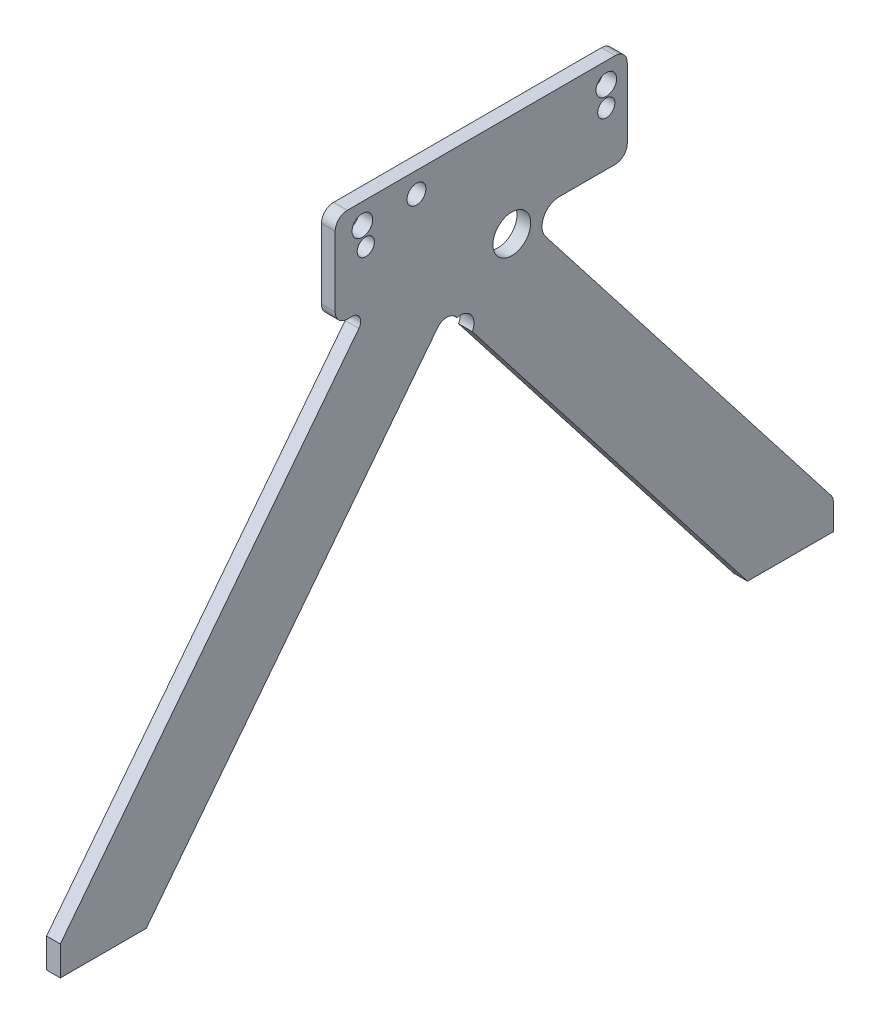
ISO-10303-21;
HEADER;
FILE_DESCRIPTION(('STEP AP214'),'2;1');
FILE_NAME('part.step','',(''),(''),'','','');
FILE_SCHEMA(('AUTOMOTIVE_DESIGN { 1 0 10303 214 1 1 1 1 }'));
ENDSEC;
DATA;
#1=APPLICATION_CONTEXT('core data for automotive mechanical design processes');
#2=APPLICATION_PROTOCOL_DEFINITION('international standard','automotive_design',2000,#1);
#3=PRODUCT_CONTEXT('',#1,'mechanical');
#4=PRODUCT('Part','Part','',(#3));
#5=PRODUCT_RELATED_PRODUCT_CATEGORY('part','',(#4));
#6=PRODUCT_DEFINITION_FORMATION('','',#4);
#7=PRODUCT_DEFINITION_CONTEXT('part definition',#1,'design');
#8=PRODUCT_DEFINITION('design','',#6,#7);
#9=PRODUCT_DEFINITION_SHAPE('','',#8);
#10=(LENGTH_UNIT() NAMED_UNIT(*) SI_UNIT(.MILLI.,.METRE.));
#11=(NAMED_UNIT(*) PLANE_ANGLE_UNIT() SI_UNIT($,.RADIAN.));
#12=(NAMED_UNIT(*) SI_UNIT($,.STERADIAN.) SOLID_ANGLE_UNIT());
#13=UNCERTAINTY_MEASURE_WITH_UNIT(LENGTH_MEASURE(1.E-05),#10,'distance_accuracy_value','');
#14=(GEOMETRIC_REPRESENTATION_CONTEXT(3) GLOBAL_UNCERTAINTY_ASSIGNED_CONTEXT((#13)) GLOBAL_UNIT_ASSIGNED_CONTEXT((#10,
#11,#12)) REPRESENTATION_CONTEXT('',''));
#15=CARTESIAN_POINT('',(0.,0.,0.));
#16=DIRECTION('',(0.,0.,1.));
#17=DIRECTION('',(1.,0.,0.));
#18=AXIS2_PLACEMENT_3D('',#15,#16,#17);
#19=CARTESIAN_POINT('',(1218.5,-25.,140.));
#20=DIRECTION('',(0.,0.,1.));
#21=DIRECTION('',(-1.,0.,0.));
#22=AXIS2_PLACEMENT_3D('',#19,#20,#21);
#23=PLANE('',#22);
#24=DIRECTION('',(1.,0.,0.));
#25=VECTOR('',#24,1.);
#26=CARTESIAN_POINT('',(678.5,17.1587321188457,140.));
#27=LINE('',#26,#25);
#28=CARTESIAN_POINT('',(670.5,17.1587321188458,140.));
#29=VERTEX_POINT('',#28);
#30=CARTESIAN_POINT('',(678.5,17.1587321188457,140.));
#31=VERTEX_POINT('',#30);
#32=EDGE_CURVE('E321',#29,#31,#27,.T.);
#33=ORIENTED_EDGE('',*,*,#32,.F.);
#34=DIRECTION('',(0.,1.,0.));
#35=VECTOR('',#34,1.);
#36=CARTESIAN_POINT('',(670.5,0.,140.));
#37=LINE('',#36,#35);
#38=CARTESIAN_POINT('',(670.5,0.,140.));
#39=VERTEX_POINT('',#38);
#40=EDGE_CURVE('E326',#39,#29,#37,.T.);
#41=ORIENTED_EDGE('',*,*,#40,.F.);
#42=DIRECTION('',(-1.,0.,0.));
#43=VECTOR('',#42,1.);
#44=CARTESIAN_POINT('',(1218.5,0.,140.));
#45=LINE('',#44,#43);
#46=CARTESIAN_POINT('',(678.500000000002,0.,140.));
#47=VERTEX_POINT('',#46);
#48=EDGE_CURVE('E322',#47,#39,#45,.T.);
#49=ORIENTED_EDGE('',*,*,#48,.F.);
#50=DIRECTION('',(0.,-1.,0.));
#51=VECTOR('',#50,1.);
#52=CARTESIAN_POINT('',(678.5,0.,140.));
#53=LINE('',#52,#51);
#54=EDGE_CURVE('E327',#31,#47,#53,.T.);
#55=ORIENTED_EDGE('',*,*,#54,.F.);
#56=EDGE_LOOP('',(#33,#41,#49,#55));
#57=FACE_BOUND('',#56,.T.);
#58=ADVANCED_FACE('F40',(#57),#23,.T.);
#59=CARTESIAN_POINT('',(1218.5,0.,115.));
#60=DIRECTION('',(0.,1.,0.));
#61=DIRECTION('',(0.,0.,1.));
#62=AXIS2_PLACEMENT_3D('',#59,#60,#61);
#63=PLANE('',#62);
#64=ORIENTED_EDGE('',*,*,#48,.T.);
#65=DIRECTION('',(0.,0.,-1.));
#66=VECTOR('',#65,1.);
#67=CARTESIAN_POINT('',(670.5,0.,89.9999999999999));
#68=LINE('',#67,#66);
#69=CARTESIAN_POINT('',(670.5,0.,89.9999999999999));
#70=VERTEX_POINT('',#69);
#71=EDGE_CURVE('E315',#39,#70,#68,.T.);
#72=ORIENTED_EDGE('',*,*,#71,.T.);
#73=DIRECTION('',(1.,0.,0.));
#74=VECTOR('',#73,1.);
#75=CARTESIAN_POINT('',(670.5,0.,89.9999999999999));
#76=LINE('',#75,#74);
#77=CARTESIAN_POINT('',(678.5,0.,89.9999999999999));
#78=VERTEX_POINT('',#77);
#79=EDGE_CURVE('E302',#70,#78,#76,.T.);
#80=ORIENTED_EDGE('',*,*,#79,.T.);
#81=DIRECTION('',(0.,0.,1.));
#82=VECTOR('',#81,1.);
#83=CARTESIAN_POINT('',(678.5,0.,89.9999999999999));
#84=LINE('',#83,#82);
#85=EDGE_CURVE('E306',#78,#47,#84,.T.);
#86=ORIENTED_EDGE('',*,*,#85,.T.);
#87=EDGE_LOOP('',(#64,#72,#80,#86));
#88=FACE_BOUND('',#87,.T.);
#89=ADVANCED_FACE('F530',(#88),#63,.F.);
#90=CARTESIAN_POINT('',(670.5,0.,89.9999999999999));
#91=DIRECTION('',(1.,0.,0.));
#92=DIRECTION('',(0.,0.,1.));
#93=AXIS2_PLACEMENT_3D('',#90,#91,#92);
#94=PLANE('',#93);
#95=DIRECTION('',(0.,0.,-1.));
#96=VECTOR('',#95,1.);
#97=CARTESIAN_POINT('',(670.5,303.487439771462,-190.));
#98=LINE('',#97,#96);
#99=CARTESIAN_POINT('',(670.5,303.487439771462,-27.0000000000004));
#100=VERTEX_POINT('',#99);
#101=CARTESIAN_POINT('',(670.5,303.487439771462,-183.));
#102=VERTEX_POINT('',#101);
#103=EDGE_CURVE('E430',#100,#102,#98,.T.);
#104=ORIENTED_EDGE('',*,*,#103,.T.);
#105=CARTESIAN_POINT('',(670.5,296.487439771462,-183.));
#106=DIRECTION('',(1.,0.,0.));
#107=DIRECTION('',(0.,0.,-1.));
#108=AXIS2_PLACEMENT_3D('',#105,#106,#107);
#109=CIRCLE('',#108,7.);
#110=CARTESIAN_POINT('',(670.5,296.487439771462,-190.));
#111=VERTEX_POINT('',#110);
#112=EDGE_CURVE('E389',#102,#111,#109,.F.);
#113=ORIENTED_EDGE('',*,*,#112,.T.);
#114=DIRECTION('',(0.,1.,0.));
#115=VECTOR('',#114,1.);
#116=CARTESIAN_POINT('',(670.5,348.622799434992,-190.));
#117=LINE('',#116,#115);
#118=CARTESIAN_POINT('',(670.5,255.622799434992,-190.));
#119=VERTEX_POINT('',#118);
#120=EDGE_CURVE('E451',#119,#111,#117,.T.);
#121=ORIENTED_EDGE('',*,*,#120,.F.);
#122=CARTESIAN_POINT('',(670.5,255.622799434992,-183.));
#123=DIRECTION('',(1.,0.,0.));
#124=DIRECTION('',(0.,0.,-1.));
#125=AXIS2_PLACEMENT_3D('',#122,#123,#124);
#126=CIRCLE('',#125,7.);
#127=CARTESIAN_POINT('',(670.5,248.622799434992,-183.));
#128=VERTEX_POINT('',#127);
#129=EDGE_CURVE('E203',#119,#128,#126,.F.);
#130=ORIENTED_EDGE('',*,*,#129,.T.);
#131=DIRECTION('',(0.,0.,1.));
#132=VECTOR('',#131,1.);
#133=CARTESIAN_POINT('',(670.5,248.622799434992,-190.));
#134=LINE('',#133,#132);
#135=CARTESIAN_POINT('',(670.5,248.622799434992,-150.377418681843));
#136=VERTEX_POINT('',#135);
#137=EDGE_CURVE('E193',#128,#136,#134,.T.);
#138=ORIENTED_EDGE('',*,*,#137,.T.);
#139=CARTESIAN_POINT('',(670.5,238.622799434992,-150.377418681843));
#140=DIRECTION('',(1.,0.,0.));
#141=DIRECTION('',(0.,0.,-1.));
#142=AXIS2_PLACEMENT_3D('',#139,#140,#141);
#143=CIRCLE('',#142,9.99999999999999);
#144=CARTESIAN_POINT('',(670.5,232.482448557799,-142.484631398192));
#145=VERTEX_POINT('',#144);
#146=EDGE_CURVE('E200',#136,#145,#143,.T.);
#147=ORIENTED_EDGE('',*,*,#146,.T.);
#148=DIRECTION('',(0.,0.789278728365052,0.614035087719298));
#149=VECTOR('',#148,1.);
#150=CARTESIAN_POINT('',(670.5,30.701754385965,-299.463936418253));
#151=LINE('',#150,#149);
#152=CARTESIAN_POINT('',(670.5,19.0547552362425,-308.524951098556));
#153=VERTEX_POINT('',#152);
#154=EDGE_CURVE('E267',#153,#145,#151,.T.);
#155=ORIENTED_EDGE('',*,*,#154,.F.);
#156=CARTESIAN_POINT('',(670.499999999999,14.7565096222074,-303.));
#157=DIRECTION('',(1.,0.,0.));
#158=DIRECTION('',(0.,0.,-1.));
#159=AXIS2_PLACEMENT_3D('',#156,#157,#158);
#160=CIRCLE('',#159,7.);
#161=CARTESIAN_POINT('',(670.5,14.7565096222074,-310.));
#162=VERTEX_POINT('',#161);
#163=EDGE_CURVE('E378',#153,#162,#160,.F.);
#164=ORIENTED_EDGE('',*,*,#163,.T.);
#165=DIRECTION('',(0.,-1.,0.));
#166=VECTOR('',#165,1.);
#167=CARTESIAN_POINT('',(670.5,30.701754385965,-310.));
#168=LINE('',#167,#166);
#169=CARTESIAN_POINT('',(670.499999999998,0.,-310.));
#170=VERTEX_POINT('',#169);
#171=EDGE_CURVE('E277',#162,#170,#168,.T.);
#172=ORIENTED_EDGE('',*,*,#171,.T.);
#173=DIRECTION('',(0.,0.,-1.));
#174=VECTOR('',#173,1.);
#175=CARTESIAN_POINT('',(670.5,0.,-299.463936418253));
#176=LINE('',#175,#174);
#177=CARTESIAN_POINT('',(670.5,0.,-260.));
#178=VERTEX_POINT('',#177);
#179=EDGE_CURVE('E268',#178,#170,#176,.T.);
#180=ORIENTED_EDGE('',*,*,#179,.F.);
#181=DIRECTION('',(0.,0.789278728365052,0.614035087719298));
#182=VECTOR('',#181,1.);
#183=CARTESIAN_POINT('',(670.5,0.,-260.));
#184=LINE('',#183,#182);
#185=CARTESIAN_POINT('',(670.5,205.90096578664,-99.8152477133378));
#186=VERTEX_POINT('',#185);
#187=EDGE_CURVE('E251',#178,#186,#184,.T.);
#188=ORIENTED_EDGE('',*,*,#187,.T.);
#189=CARTESIAN_POINT('',(670.5,209.737439771461,-92.7951716907497));
#190=DIRECTION('',(1.,0.,0.));
#191=DIRECTION('',(0.,0.,-1.));
#192=AXIS2_PLACEMENT_3D('',#189,#190,#191);
#193=CIRCLE('',#192,7.9999999999453);
#194=CARTESIAN_POINT('',(670.5,217.485399590374,-90.8029069885487));
#195=VERTEX_POINT('',#194);
#196=EDGE_CURVE('E241',#186,#195,#193,.T.);
#197=ORIENTED_EDGE('',*,*,#196,.T.);
#198=CARTESIAN_POINT('',(670.5,217.842683198075,-90.5249510985555));
#199=VERTEX_POINT('',#198);
#200=EDGE_CURVE('E256',#195,#199,#184,.T.);
#201=ORIENTED_EDGE('',*,*,#200,.T.);
#202=CARTESIAN_POINT('',(670.5,213.54443758404,-85.0000000000001));
#203=DIRECTION('',(1.,0.,0.));
#204=DIRECTION('',(0.,0.,-1.));
#205=AXIS2_PLACEMENT_3D('',#202,#203,#204);
#206=CIRCLE('',#205,7.);
#207=CARTESIAN_POINT('',(670.5,217.842683198075,-79.4750489014448));
#208=VERTEX_POINT('',#207);
#209=EDGE_CURVE('E49',#199,#208,#206,.T.);
#210=ORIENTED_EDGE('',*,*,#209,.T.);
#211=DIRECTION('',(0.,0.789278728365052,-0.614035087719298));
#212=VECTOR('',#211,1.);
#213=CARTESIAN_POINT('',(670.5,0.,89.9999999999999));
#214=LINE('',#213,#212);
#215=EDGE_CURVE('E295',#70,#208,#214,.T.);
#216=ORIENTED_EDGE('',*,*,#215,.F.);
#217=ORIENTED_EDGE('',*,*,#71,.F.);
#218=ORIENTED_EDGE('',*,*,#40,.T.);
#219=DIRECTION('',(0.,0.789278728365052,-0.614035087719298));
#220=VECTOR('',#219,1.);
#221=CARTESIAN_POINT('',(670.5,30.701754385965,129.463936418253));
#222=LINE('',#221,#220);
#223=CARTESIAN_POINT('',(670.5,240.552623996395,-33.7937221228935));
#224=VERTEX_POINT('',#223);
#225=EDGE_CURVE('E311',#29,#224,#222,.T.);
#226=ORIENTED_EDGE('',*,*,#225,.T.);
#227=CARTESIAN_POINT('',(670.5,243.622799434992,-29.8473284810682));
#228=DIRECTION('',(1.,0.,0.));
#229=DIRECTION('',(0.,0.,-1.));
#230=AXIS2_PLACEMENT_3D('',#227,#228,#229);
#231=CIRCLE('',#230,5.);
#232=CARTESIAN_POINT('',(670.5,248.622799434992,-29.8473284810682));
#233=VERTEX_POINT('',#232);
#234=EDGE_CURVE('E414',#224,#233,#231,.T.);
#235=ORIENTED_EDGE('',*,*,#234,.T.);
#236=CARTESIAN_POINT('',(670.5,248.622799434992,-27.0000000000004));
#237=VERTEX_POINT('',#236);
#238=EDGE_CURVE('E208',#233,#237,#134,.T.);
#239=ORIENTED_EDGE('',*,*,#238,.T.);
#240=CARTESIAN_POINT('',(670.5,255.622799434992,-27.0000000000004));
#241=DIRECTION('',(1.,0.,0.));
#242=DIRECTION('',(0.,0.,-1.));
#243=AXIS2_PLACEMENT_3D('',#240,#241,#242);
#244=CIRCLE('',#243,7.);
#245=CARTESIAN_POINT('',(670.5,255.622799434992,-20.0000000000004));
#246=VERTEX_POINT('',#245);
#247=EDGE_CURVE('E381',#237,#246,#244,.F.);
#248=ORIENTED_EDGE('',*,*,#247,.T.);
#249=DIRECTION('',(0.,1.,0.));
#250=VECTOR('',#249,1.);
#251=CARTESIAN_POINT('',(670.5,348.622799434992,-20.0000000000004));
#252=LINE('',#251,#250);
#253=CARTESIAN_POINT('',(670.5,296.487439771462,-20.0000000000004));
#254=VERTEX_POINT('',#253);
#255=EDGE_CURVE('E423',#246,#254,#252,.T.);
#256=ORIENTED_EDGE('',*,*,#255,.T.);
#257=CARTESIAN_POINT('',(670.500000000001,296.487439771462,-27.0000000000004));
#258=DIRECTION('',(1.,0.,0.));
#259=DIRECTION('',(0.,0.,-1.));
#260=AXIS2_PLACEMENT_3D('',#257,#258,#259);
#261=CIRCLE('',#260,7.);
#262=EDGE_CURVE('E386',#254,#100,#261,.F.);
#263=ORIENTED_EDGE('',*,*,#262,.T.);
#264=EDGE_LOOP('',(#104,#113,#121,#130,#138,#147,#155,#164,#172,#180,#188,#197,#201,#210,#216,
#217,#218,#226,#235,#239,#248,#256,#263));
#265=FACE_BOUND('',#264,.T.);
#266=CARTESIAN_POINT('',(670.5,243.73743977146,-122.79517169075));
#267=DIRECTION('',(1.,0.,0.));
#268=DIRECTION('',(0.,0.,-1.));
#269=AXIS2_PLACEMENT_3D('',#266,#267,#268);
#270=CIRCLE('',#269,10.9999999999903);
#271=CARTESIAN_POINT('',(670.5,243.73743977146,-133.79517169074));
#272=VERTEX_POINT('',#271);
#273=EDGE_CURVE('E246',#272,#272,#270,.T.);
#274=ORIENTED_EDGE('',*,*,#273,.T.);
#275=EDGE_LOOP('',(#274));
#276=FACE_BOUND('',#275,.T.);
#277=CARTESIAN_POINT('',(670.5,279.737439771462,-37.795171690751));
#278=DIRECTION('',(1.,0.,0.));
#279=DIRECTION('',(0.,0.,-1.));
#280=AXIS2_PLACEMENT_3D('',#277,#278,#279);
#281=CIRCLE('',#280,4.99999999994735);
#282=CARTESIAN_POINT('',(670.5,279.737439771462,-42.7951716906983));
#283=VERTEX_POINT('',#282);
#284=EDGE_CURVE('E236',#283,#283,#281,.T.);
#285=ORIENTED_EDGE('',*,*,#284,.T.);
#286=EDGE_LOOP('',(#285));
#287=FACE_BOUND('',#286,.T.);
#288=CARTESIAN_POINT('',(670.5,291.487439771464,-177.795171690753));
#289=DIRECTION('',(1.,0.,0.));
#290=DIRECTION('',(0.,0.,-1.));
#291=AXIS2_PLACEMENT_3D('',#288,#289,#290);
#292=CIRCLE('',#291,5.99999999996128);
#293=CARTESIAN_POINT('',(670.5,291.487439771464,-183.795171690715));
#294=VERTEX_POINT('',#293);
#295=EDGE_CURVE('E500',#294,#294,#292,.T.);
#296=ORIENTED_EDGE('',*,*,#295,.T.);
#297=EDGE_LOOP('',(#296));
#298=FACE_BOUND('',#297,.T.);
#299=CARTESIAN_POINT('',(670.5,279.737439771459,-177.795171690751));
#300=DIRECTION('',(1.,0.,0.));
#301=DIRECTION('',(0.,0.,-1.));
#302=AXIS2_PLACEMENT_3D('',#299,#300,#301);
#303=CIRCLE('',#302,4.99999999994802);
#304=CARTESIAN_POINT('',(670.5,279.737439771459,-182.795171690699));
#305=VERTEX_POINT('',#304);
#306=EDGE_CURVE('E495',#305,#305,#303,.T.);
#307=ORIENTED_EDGE('',*,*,#306,.T.);
#308=EDGE_LOOP('',(#307));
#309=FACE_BOUND('',#308,.T.);
#310=CARTESIAN_POINT('',(670.5,291.487439771462,-35.7951716907509));
#311=DIRECTION('',(1.,0.,0.));
#312=DIRECTION('',(0.,0.,-1.));
#313=AXIS2_PLACEMENT_3D('',#310,#311,#312);
#314=CIRCLE('',#313,5.9999999999686);
#315=CARTESIAN_POINT('',(670.5,291.487439771462,-41.7951716907195));
#316=VERTEX_POINT('',#315);
#317=EDGE_CURVE('E490',#316,#316,#314,.T.);
#318=ORIENTED_EDGE('',*,*,#317,.T.);
#319=EDGE_LOOP('',(#318));
#320=FACE_BOUND('',#319,.T.);
#321=CARTESIAN_POINT('',(670.5,291.487439771461,-67.2951716907509));
#322=DIRECTION('',(1.,0.,0.));
#323=DIRECTION('',(0.,0.,-1.));
#324=AXIS2_PLACEMENT_3D('',#321,#322,#323);
#325=CIRCLE('',#324,5.49999999995604);
#326=CARTESIAN_POINT('',(670.5,291.487439771461,-72.795171690707));
#327=VERTEX_POINT('',#326);
#328=EDGE_CURVE('E433',#327,#327,#325,.T.);
#329=ORIENTED_EDGE('',*,*,#328,.T.);
#330=EDGE_LOOP('',(#329));
#331=FACE_BOUND('',#330,.T.);
#332=ADVANCED_FACE('F196',(#265,#276,#287,#298,#309,#320,#331),#94,.F.);
#333=CARTESIAN_POINT('',(678.5,30.701754385965,129.463936418252));
#334=DIRECTION('',(0.,-0.614035087719298,-0.789278728365052));
#335=DIRECTION('',(0.,0.789278728365052,-0.614035087719298));
#336=AXIS2_PLACEMENT_3D('',#333,#334,#335);
#337=PLANE('',#336);
#338=DIRECTION('',(0.,0.789278728365052,-0.614035087719298));
#339=VECTOR('',#338,1.);
#340=CARTESIAN_POINT('',(678.5,30.701754385965,129.463936418252));
#341=LINE('',#340,#339);
#342=CARTESIAN_POINT('',(678.5,240.552623996395,-33.7937221228936));
#343=VERTEX_POINT('',#342);
#344=EDGE_CURVE('E307',#31,#343,#341,.T.);
#345=ORIENTED_EDGE('',*,*,#344,.T.);
#346=DIRECTION('',(-1.,0.,0.));
#347=VECTOR('',#346,1.);
#348=CARTESIAN_POINT('',(670.5,240.552623996395,-33.7937221228935));
#349=LINE('',#348,#347);
#350=EDGE_CURVE('E337',#343,#224,#349,.T.);
#351=ORIENTED_EDGE('',*,*,#350,.T.);
#352=ORIENTED_EDGE('',*,*,#225,.F.);
#353=ORIENTED_EDGE('',*,*,#32,.T.);
#354=EDGE_LOOP('',(#345,#351,#352,#353));
#355=FACE_BOUND('',#354,.T.);
#356=ADVANCED_FACE('F534',(#355),#337,.F.);
#357=CARTESIAN_POINT('',(678.5,0.,89.9999999999999));
#358=DIRECTION('',(-1.,0.,0.));
#359=DIRECTION('',(0.,0.,-1.));
#360=AXIS2_PLACEMENT_3D('',#357,#358,#359);
#361=PLANE('',#360);
#362=DIRECTION('',(0.,-1.,0.));
#363=VECTOR('',#362,1.);
#364=CARTESIAN_POINT('',(678.5,348.622799434992,-190.));
#365=LINE('',#364,#363);
#366=CARTESIAN_POINT('',(678.5,296.487439771462,-190.));
#367=VERTEX_POINT('',#366);
#368=CARTESIAN_POINT('',(678.5,255.622799434992,-190.));
#369=VERTEX_POINT('',#368);
#370=EDGE_CURVE('E427',#367,#369,#365,.T.);
#371=ORIENTED_EDGE('',*,*,#370,.F.);
#372=CARTESIAN_POINT('',(678.5,296.487439771462,-183.));
#373=DIRECTION('',(-1.,0.,0.));
#374=DIRECTION('',(0.,0.,1.));
#375=AXIS2_PLACEMENT_3D('',#372,#373,#374);
#376=CIRCLE('',#375,7.);
#377=CARTESIAN_POINT('',(678.499999999998,303.487439771462,-183.));
#378=VERTEX_POINT('',#377);
#379=EDGE_CURVE('E368',#367,#378,#376,.F.);
#380=ORIENTED_EDGE('',*,*,#379,.T.);
#381=DIRECTION('',(0.,0.,-1.));
#382=VECTOR('',#381,1.);
#383=CARTESIAN_POINT('',(678.499999999998,303.487439771462,-1.93856793595813E-12));
#384=LINE('',#383,#382);
#385=CARTESIAN_POINT('',(678.499999999998,303.487439771462,-27.0000000000004));
#386=VERTEX_POINT('',#385);
#387=EDGE_CURVE('E434',#386,#378,#384,.T.);
#388=ORIENTED_EDGE('',*,*,#387,.F.);
#389=CARTESIAN_POINT('',(678.500000000001,296.487439771462,-27.0000000000004));
#390=DIRECTION('',(-1.,0.,0.));
#391=DIRECTION('',(0.,0.,1.));
#392=AXIS2_PLACEMENT_3D('',#389,#390,#391);
#393=CIRCLE('',#392,7.);
#394=CARTESIAN_POINT('',(678.5,296.487439771462,-20.0000000000004));
#395=VERTEX_POINT('',#394);
#396=EDGE_CURVE('E365',#386,#395,#393,.F.);
#397=ORIENTED_EDGE('',*,*,#396,.T.);
#398=DIRECTION('',(0.,-1.,0.));
#399=VECTOR('',#398,1.);
#400=CARTESIAN_POINT('',(678.5,348.622799434992,-20.0000000000004));
#401=LINE('',#400,#399);
#402=CARTESIAN_POINT('',(678.5,255.622799434992,-20.0000000000004));
#403=VERTEX_POINT('',#402);
#404=EDGE_CURVE('E428',#395,#403,#401,.T.);
#405=ORIENTED_EDGE('',*,*,#404,.T.);
#406=CARTESIAN_POINT('',(678.5,255.622799434992,-27.0000000000004));
#407=DIRECTION('',(-1.,0.,0.));
#408=DIRECTION('',(0.,0.,1.));
#409=AXIS2_PLACEMENT_3D('',#406,#407,#408);
#410=CIRCLE('',#409,7.);
#411=CARTESIAN_POINT('',(678.5,248.622799434992,-27.0000000000004));
#412=VERTEX_POINT('',#411);
#413=EDGE_CURVE('E359',#403,#412,#410,.F.);
#414=ORIENTED_EDGE('',*,*,#413,.T.);
#415=DIRECTION('',(0.,0.,1.));
#416=VECTOR('',#415,1.);
#417=CARTESIAN_POINT('',(678.5,248.622799434992,-190.));
#418=LINE('',#417,#416);
#419=CARTESIAN_POINT('',(678.5,248.622799434992,-29.8473284810682));
#420=VERTEX_POINT('',#419);
#421=EDGE_CURVE('E207',#420,#412,#418,.T.);
#422=ORIENTED_EDGE('',*,*,#421,.F.);
#423=CARTESIAN_POINT('',(678.5,243.622799434992,-29.8473284810682));
#424=DIRECTION('',(-1.,0.,0.));
#425=DIRECTION('',(0.,0.,1.));
#426=AXIS2_PLACEMENT_3D('',#423,#424,#425);
#427=CIRCLE('',#426,5.);
#428=EDGE_CURVE('E417',#420,#343,#427,.T.);
#429=ORIENTED_EDGE('',*,*,#428,.T.);
#430=ORIENTED_EDGE('',*,*,#344,.F.);
#431=ORIENTED_EDGE('',*,*,#54,.T.);
#432=ORIENTED_EDGE('',*,*,#85,.F.);
#433=DIRECTION('',(0.,0.789278728365052,-0.614035087719298));
#434=VECTOR('',#433,1.);
#435=CARTESIAN_POINT('',(678.5,0.,89.9999999999999));
#436=LINE('',#435,#434);
#437=CARTESIAN_POINT('',(678.5,217.842683198075,-79.4750489014448));
#438=VERTEX_POINT('',#437);
#439=EDGE_CURVE('E298',#78,#438,#436,.T.);
#440=ORIENTED_EDGE('',*,*,#439,.T.);
#441=CARTESIAN_POINT('',(678.5,213.54443758404,-85.0000000000002));
#442=DIRECTION('',(-1.,0.,0.));
#443=DIRECTION('',(0.,0.,1.));
#444=AXIS2_PLACEMENT_3D('',#441,#442,#443);
#445=CIRCLE('',#444,7.);
#446=CARTESIAN_POINT('',(678.5,217.842683198075,-90.5249510985556));
#447=VERTEX_POINT('',#446);
#448=EDGE_CURVE('E12',#438,#447,#445,.T.);
#449=ORIENTED_EDGE('',*,*,#448,.T.);
#450=DIRECTION('',(0.,0.789278728365052,0.614035087719298));
#451=VECTOR('',#450,1.);
#452=CARTESIAN_POINT('',(678.5,0.,-260.));
#453=LINE('',#452,#451);
#454=CARTESIAN_POINT('',(678.499999999999,217.485399590374,-90.8029069885487));
#455=VERTEX_POINT('',#454);
#456=EDGE_CURVE('E255',#455,#447,#453,.T.);
#457=ORIENTED_EDGE('',*,*,#456,.F.);
#458=CARTESIAN_POINT('',(678.499999999999,209.737439771461,-92.7951716907497));
#459=DIRECTION('',(1.,0.,0.));
#460=DIRECTION('',(0.,1.,0.));
#461=AXIS2_PLACEMENT_3D('',#458,#459,#460);
#462=CIRCLE('',#461,7.9999999999453);
#463=CARTESIAN_POINT('',(678.499999999999,205.90096578664,-99.8152477133378));
#464=VERTEX_POINT('',#463);
#465=EDGE_CURVE('E230',#464,#455,#462,.T.);
#466=ORIENTED_EDGE('',*,*,#465,.F.);
#467=CARTESIAN_POINT('',(678.5,0.,-260.));
#468=VERTEX_POINT('',#467);
#469=EDGE_CURVE('E257',#468,#464,#453,.T.);
#470=ORIENTED_EDGE('',*,*,#469,.F.);
#471=DIRECTION('',(0.,0.,1.));
#472=VECTOR('',#471,1.);
#473=CARTESIAN_POINT('',(678.5,0.,-299.463936418253));
#474=LINE('',#473,#472);
#475=CARTESIAN_POINT('',(678.5,0.,-310.));
#476=VERTEX_POINT('',#475);
#477=EDGE_CURVE('E261',#476,#468,#474,.T.);
#478=ORIENTED_EDGE('',*,*,#477,.F.);
#479=DIRECTION('',(0.,1.,0.));
#480=VECTOR('',#479,1.);
#481=CARTESIAN_POINT('',(678.5,30.701754385965,-310.));
#482=LINE('',#481,#480);
#483=CARTESIAN_POINT('',(678.5,14.7565096222074,-310.));
#484=VERTEX_POINT('',#483);
#485=EDGE_CURVE('E276',#476,#484,#482,.T.);
#486=ORIENTED_EDGE('',*,*,#485,.T.);
#487=CARTESIAN_POINT('',(678.499999999999,14.7565096222074,-303.));
#488=DIRECTION('',(-1.,0.,0.));
#489=DIRECTION('',(0.,0.,1.));
#490=AXIS2_PLACEMENT_3D('',#487,#488,#489);
#491=CIRCLE('',#490,7.);
#492=CARTESIAN_POINT('',(678.5,19.0547552362425,-308.524951098556));
#493=VERTEX_POINT('',#492);
#494=EDGE_CURVE('E356',#484,#493,#491,.F.);
#495=ORIENTED_EDGE('',*,*,#494,.T.);
#496=DIRECTION('',(0.,0.789278728365052,0.614035087719298));
#497=VECTOR('',#496,1.);
#498=CARTESIAN_POINT('',(678.5,30.701754385965,-299.463936418253));
#499=LINE('',#498,#497);
#500=CARTESIAN_POINT('',(678.5,232.482448557799,-142.484631398192));
#501=VERTEX_POINT('',#500);
#502=EDGE_CURVE('E272',#493,#501,#499,.T.);
#503=ORIENTED_EDGE('',*,*,#502,.T.);
#504=CARTESIAN_POINT('',(678.5,238.622799434992,-150.377418681843));
#505=DIRECTION('',(-1.,0.,0.));
#506=DIRECTION('',(0.,0.,1.));
#507=AXIS2_PLACEMENT_3D('',#504,#505,#506);
#508=CIRCLE('',#507,9.99999999999999);
#509=CARTESIAN_POINT('',(678.5,248.622799434992,-150.377418681843));
#510=VERTEX_POINT('',#509);
#511=EDGE_CURVE('E220',#501,#510,#508,.T.);
#512=ORIENTED_EDGE('',*,*,#511,.T.);
#513=CARTESIAN_POINT('',(678.5,248.622799434992,-183.));
#514=VERTEX_POINT('',#513);
#515=EDGE_CURVE('E214',#514,#510,#418,.T.);
#516=ORIENTED_EDGE('',*,*,#515,.F.);
#517=CARTESIAN_POINT('',(678.5,255.622799434992,-183.));
#518=DIRECTION('',(-1.,0.,0.));
#519=DIRECTION('',(0.,0.,1.));
#520=AXIS2_PLACEMENT_3D('',#517,#518,#519);
#521=CIRCLE('',#520,7.);
#522=EDGE_CURVE('E362',#514,#369,#521,.F.);
#523=ORIENTED_EDGE('',*,*,#522,.T.);
#524=EDGE_LOOP('',(#371,#380,#388,#397,#405,#414,#422,#429,#430,#431,#432,#440,#449,#457,#466,
#470,#478,#486,#495,#503,#512,#516,#523));
#525=FACE_BOUND('',#524,.T.);
#526=CARTESIAN_POINT('',(678.499999999998,243.73743977146,-122.79517169075));
#527=DIRECTION('',(1.,0.,0.));
#528=DIRECTION('',(0.,1.,0.));
#529=AXIS2_PLACEMENT_3D('',#526,#527,#528);
#530=CIRCLE('',#529,10.9999999999903);
#531=CARTESIAN_POINT('',(678.499999999998,254.737439771451,-122.79517169075));
#532=VERTEX_POINT('',#531);
#533=EDGE_CURVE('E225',#532,#532,#530,.T.);
#534=ORIENTED_EDGE('',*,*,#533,.F.);
#535=EDGE_LOOP('',(#534));
#536=FACE_BOUND('',#535,.T.);
#537=CARTESIAN_POINT('',(678.499999999998,279.737439771462,-37.795171690751));
#538=DIRECTION('',(1.,0.,0.));
#539=DIRECTION('',(0.,1.,0.));
#540=AXIS2_PLACEMENT_3D('',#537,#538,#539);
#541=CIRCLE('',#540,4.99999999994735);
#542=CARTESIAN_POINT('',(678.499999999998,284.737439771409,-37.795171690751));
#543=VERTEX_POINT('',#542);
#544=EDGE_CURVE('E443',#543,#543,#541,.T.);
#545=ORIENTED_EDGE('',*,*,#544,.F.);
#546=EDGE_LOOP('',(#545));
#547=FACE_BOUND('',#546,.T.);
#548=CARTESIAN_POINT('',(678.499999999998,291.487439771464,-177.795171690753));
#549=DIRECTION('',(1.,0.,0.));
#550=DIRECTION('',(0.,1.,0.));
#551=AXIS2_PLACEMENT_3D('',#548,#549,#550);
#552=CIRCLE('',#551,5.99999999996128);
#553=CARTESIAN_POINT('',(678.499999999998,297.487439771425,-177.795171690753));
#554=VERTEX_POINT('',#553);
#555=EDGE_CURVE('E466',#554,#554,#552,.T.);
#556=ORIENTED_EDGE('',*,*,#555,.F.);
#557=EDGE_LOOP('',(#556));
#558=FACE_BOUND('',#557,.T.);
#559=CARTESIAN_POINT('',(678.499999999998,279.737439771459,-177.795171690751));
#560=DIRECTION('',(1.,0.,0.));
#561=DIRECTION('',(0.,1.,0.));
#562=AXIS2_PLACEMENT_3D('',#559,#560,#561);
#563=CIRCLE('',#562,4.99999999994802);
#564=CARTESIAN_POINT('',(678.499999999998,284.737439771407,-177.795171690751));
#565=VERTEX_POINT('',#564);
#566=EDGE_CURVE('E471',#565,#565,#563,.T.);
#567=ORIENTED_EDGE('',*,*,#566,.F.);
#568=EDGE_LOOP('',(#567));
#569=FACE_BOUND('',#568,.T.);
#570=CARTESIAN_POINT('',(678.499999999998,291.487439771462,-35.7951716907509));
#571=DIRECTION('',(1.,0.,0.));
#572=DIRECTION('',(0.,1.,0.));
#573=AXIS2_PLACEMENT_3D('',#570,#571,#572);
#574=CIRCLE('',#573,5.9999999999686);
#575=CARTESIAN_POINT('',(678.499999999998,297.487439771431,-35.7951716907509));
#576=VERTEX_POINT('',#575);
#577=EDGE_CURVE('E476',#576,#576,#574,.T.);
#578=ORIENTED_EDGE('',*,*,#577,.F.);
#579=EDGE_LOOP('',(#578));
#580=FACE_BOUND('',#579,.T.);
#581=CARTESIAN_POINT('',(678.499999999998,291.487439771461,-67.295171690751));
#582=DIRECTION('',(1.,0.,0.));
#583=DIRECTION('',(0.,1.,0.));
#584=AXIS2_PLACEMENT_3D('',#581,#582,#583);
#585=CIRCLE('',#584,5.49999999995604);
#586=CARTESIAN_POINT('',(678.499999999998,296.987439771417,-67.295171690751));
#587=VERTEX_POINT('',#586);
#588=EDGE_CURVE('E481',#587,#587,#585,.T.);
#589=ORIENTED_EDGE('',*,*,#588,.F.);
#590=EDGE_LOOP('',(#589));
#591=FACE_BOUND('',#590,.T.);
#592=ADVANCED_FACE('F519',(#525,#536,#547,#558,#569,#580,#591),#361,.F.);
#593=CARTESIAN_POINT('',(670.5,0.,89.9999999999999));
#594=DIRECTION('',(0.,0.614035087719298,0.789278728365052));
#595=DIRECTION('',(0.,-0.789278728365052,0.614035087719298));
#596=AXIS2_PLACEMENT_3D('',#593,#594,#595);
#597=PLANE('',#596);
#598=ORIENTED_EDGE('',*,*,#215,.T.);
#599=DIRECTION('',(-1.,0.,0.));
#600=VECTOR('',#599,1.);
#601=CARTESIAN_POINT('',(678.5,217.842683198075,-79.4750489014448));
#602=LINE('',#601,#600);
#603=EDGE_CURVE('E411',#208,#438,#602,.F.);
#604=ORIENTED_EDGE('',*,*,#603,.T.);
#605=ORIENTED_EDGE('',*,*,#439,.F.);
#606=ORIENTED_EDGE('',*,*,#79,.F.);
#607=EDGE_LOOP('',(#598,#604,#605,#606));
#608=FACE_BOUND('',#607,.T.);
#609=ADVANCED_FACE('F525',(#608),#597,.F.);
#610=CARTESIAN_POINT('',(678.5,0.,-260.));
#611=DIRECTION('',(0.,0.614035087719298,-0.789278728365052));
#612=DIRECTION('',(0.,0.789278728365052,0.614035087719298));
#613=AXIS2_PLACEMENT_3D('',#610,#611,#612);
#614=PLANE('',#613);
#615=ORIENTED_EDGE('',*,*,#456,.T.);
#616=DIRECTION('',(-1.,0.,0.));
#617=VECTOR('',#616,1.);
#618=CARTESIAN_POINT('',(670.5,217.842683198075,-90.5249510985555));
#619=LINE('',#618,#617);
#620=EDGE_CURVE('E408',#447,#199,#619,.T.);
#621=ORIENTED_EDGE('',*,*,#620,.T.);
#622=ORIENTED_EDGE('',*,*,#200,.F.);
#623=DIRECTION('',(1.,0.,0.));
#624=VECTOR('',#623,1.);
#625=CARTESIAN_POINT('',(668.499999999999,217.485399590374,-90.8029069885486));
#626=LINE('',#625,#624);
#627=EDGE_CURVE('E291',#195,#455,#626,.T.);
#628=ORIENTED_EDGE('',*,*,#627,.T.);
#629=EDGE_LOOP('',(#615,#621,#622,#628));
#630=FACE_BOUND('',#629,.T.);
#631=ADVANCED_FACE('F514',(#630),#614,.F.);
#632=CARTESIAN_POINT('',(670.5,30.701754385965,-299.463936418253));
#633=DIRECTION('',(0.,-0.614035087719298,0.789278728365052));
#634=DIRECTION('',(0.,-0.789278728365052,-0.614035087719298));
#635=AXIS2_PLACEMENT_3D('',#632,#633,#634);
#636=PLANE('',#635);
#637=ORIENTED_EDGE('',*,*,#502,.F.);
#638=DIRECTION('',(-1.,0.,0.));
#639=VECTOR('',#638,1.);
#640=CARTESIAN_POINT('',(670.5,19.0547552362425,-308.524951098556));
#641=LINE('',#640,#639);
#642=EDGE_CURVE('E401',#493,#153,#641,.T.);
#643=ORIENTED_EDGE('',*,*,#642,.T.);
#644=ORIENTED_EDGE('',*,*,#154,.T.);
#645=DIRECTION('',(1.,0.,0.));
#646=VECTOR('',#645,1.);
#647=CARTESIAN_POINT('',(646.526176707307,232.482448557799,-142.484631398193));
#648=LINE('',#647,#646);
#649=EDGE_CURVE('E219',#145,#501,#648,.T.);
#650=ORIENTED_EDGE('',*,*,#649,.T.);
#651=EDGE_LOOP('',(#637,#643,#644,#650));
#652=FACE_BOUND('',#651,.T.);
#653=ADVANCED_FACE('F577',(#652),#636,.F.);
#654=CARTESIAN_POINT('',(1218.5,0.,-285.));
#655=DIRECTION('',(0.,1.,0.));
#656=DIRECTION('',(0.,0.,1.));
#657=AXIS2_PLACEMENT_3D('',#654,#655,#656);
#658=PLANE('',#657);
#659=DIRECTION('',(-1.,0.,0.));
#660=VECTOR('',#659,1.);
#661=CARTESIAN_POINT('',(678.5,0.,-260.));
#662=LINE('',#661,#660);
#663=EDGE_CURVE('E250',#468,#178,#662,.T.);
#664=ORIENTED_EDGE('',*,*,#663,.T.);
#665=ORIENTED_EDGE('',*,*,#179,.T.);
#666=DIRECTION('',(1.,0.,0.));
#667=VECTOR('',#666,1.);
#668=CARTESIAN_POINT('',(1218.5,0.,-310.));
#669=LINE('',#668,#667);
#670=EDGE_CURVE('E273',#170,#476,#669,.T.);
#671=ORIENTED_EDGE('',*,*,#670,.T.);
#672=ORIENTED_EDGE('',*,*,#477,.T.);
#673=EDGE_LOOP('',(#664,#665,#671,#672));
#674=FACE_BOUND('',#673,.T.);
#675=ADVANCED_FACE('F693',(#674),#658,.F.);
#676=CARTESIAN_POINT('',(1218.5,-25.,-310.));
#677=DIRECTION('',(0.,0.,-1.));
#678=DIRECTION('',(1.,0.,0.));
#679=AXIS2_PLACEMENT_3D('',#676,#677,#678);
#680=PLANE('',#679);
#681=ORIENTED_EDGE('',*,*,#171,.F.);
#682=DIRECTION('',(-1.,0.,0.));
#683=VECTOR('',#682,1.);
#684=CARTESIAN_POINT('',(678.5,14.7565096222074,-310.));
#685=LINE('',#684,#683);
#686=EDGE_CURVE('E405',#162,#484,#685,.F.);
#687=ORIENTED_EDGE('',*,*,#686,.T.);
#688=ORIENTED_EDGE('',*,*,#485,.F.);
#689=ORIENTED_EDGE('',*,*,#670,.F.);
#690=EDGE_LOOP('',(#681,#687,#688,#689));
#691=FACE_BOUND('',#690,.T.);
#692=ADVANCED_FACE('F584',(#691),#680,.T.);
#693=ORIENTED_EDGE('',*,*,#469,.T.);
#694=DIRECTION('',(1.,0.,0.));
#695=VECTOR('',#694,1.);
#696=CARTESIAN_POINT('',(668.499999999999,205.90096578664,-99.8152477133378));
#697=LINE('',#696,#695);
#698=EDGE_CURVE('E280',#464,#186,#697,.F.);
#699=ORIENTED_EDGE('',*,*,#698,.T.);
#700=ORIENTED_EDGE('',*,*,#187,.F.);
#701=ORIENTED_EDGE('',*,*,#663,.F.);
#702=EDGE_LOOP('',(#693,#699,#700,#701));
#703=FACE_BOUND('',#702,.T.);
#704=ADVANCED_FACE('F692',(#703),#614,.F.);
#705=CARTESIAN_POINT('',(668.499999999999,209.737439771461,-92.7951716907497));
#706=DIRECTION('',(1.,0.,0.));
#707=DIRECTION('',(0.,1.,0.));
#708=AXIS2_PLACEMENT_3D('',#705,#706,#707);
#709=CYLINDRICAL_SURFACE('',#708,7.9999999999453);
#710=ORIENTED_EDGE('',*,*,#196,.F.);
#711=ORIENTED_EDGE('',*,*,#698,.F.);
#712=ORIENTED_EDGE('',*,*,#465,.T.);
#713=ORIENTED_EDGE('',*,*,#627,.F.);
#714=EDGE_LOOP('',(#710,#711,#712,#713));
#715=FACE_BOUND('',#714,.T.);
#716=ADVANCED_FACE('F703',(#715),#709,.F.);
#717=CARTESIAN_POINT('',(668.499999999998,243.73743977146,-122.79517169075));
#718=DIRECTION('',(1.,0.,0.));
#719=DIRECTION('',(0.,1.,0.));
#720=AXIS2_PLACEMENT_3D('',#717,#718,#719);
#721=CYLINDRICAL_SURFACE('',#720,10.9999999999903);
#722=ORIENTED_EDGE('',*,*,#533,.T.);
#723=EDGE_LOOP('',(#722));
#724=FACE_BOUND('',#723,.T.);
#725=ORIENTED_EDGE('',*,*,#273,.F.);
#726=EDGE_LOOP('',(#725));
#727=FACE_BOUND('',#726,.T.);
#728=ADVANCED_FACE('F750',(#724,#727),#721,.F.);
#729=CARTESIAN_POINT('',(646.526176707307,238.622799434992,-150.377418681843));
#730=DIRECTION('',(1.,0.,0.));
#731=DIRECTION('',(0.,0.,-1.));
#732=AXIS2_PLACEMENT_3D('',#729,#730,#731);
#733=CYLINDRICAL_SURFACE('',#732,9.99999999999999);
#734=ORIENTED_EDGE('',*,*,#146,.F.);
#735=DIRECTION('',(1.,0.,0.));
#736=VECTOR('',#735,1.);
#737=CARTESIAN_POINT('',(646.526176707307,248.622799434992,-150.377418681843));
#738=LINE('',#737,#736);
#739=EDGE_CURVE('E211',#136,#510,#738,.T.);
#740=ORIENTED_EDGE('',*,*,#739,.T.);
#741=ORIENTED_EDGE('',*,*,#511,.F.);
#742=ORIENTED_EDGE('',*,*,#649,.F.);
#743=EDGE_LOOP('',(#734,#740,#741,#742));
#744=FACE_BOUND('',#743,.T.);
#745=ADVANCED_FACE('F222',(#744),#733,.F.);
#746=CARTESIAN_POINT('',(670.5,248.622799434992,-190.));
#747=DIRECTION('',(0.,1.,0.));
#748=DIRECTION('',(0.,0.,1.));
#749=AXIS2_PLACEMENT_3D('',#746,#747,#748);
#750=PLANE('',#749);
#751=ORIENTED_EDGE('',*,*,#238,.F.);
#752=DIRECTION('',(-1.,0.,0.));
#753=VECTOR('',#752,1.);
#754=CARTESIAN_POINT('',(678.5,248.622799434992,-29.8473284810682));
#755=LINE('',#754,#753);
#756=EDGE_CURVE('E345',#233,#420,#755,.F.);
#757=ORIENTED_EDGE('',*,*,#756,.T.);
#758=ORIENTED_EDGE('',*,*,#421,.T.);
#759=DIRECTION('',(-1.,0.,0.));
#760=VECTOR('',#759,1.);
#761=CARTESIAN_POINT('',(670.5,248.622799434992,-27.0000000000004));
#762=LINE('',#761,#760);
#763=EDGE_CURVE('E341',#412,#237,#762,.T.);
#764=ORIENTED_EDGE('',*,*,#763,.T.);
#765=EDGE_LOOP('',(#751,#757,#758,#764));
#766=FACE_BOUND('',#765,.T.);
#767=ADVANCED_FACE('F540',(#766),#750,.F.);
#768=ORIENTED_EDGE('',*,*,#137,.F.);
#769=DIRECTION('',(-1.,0.,0.));
#770=VECTOR('',#769,1.);
#771=CARTESIAN_POINT('',(670.5,248.622799434992,-183.));
#772=LINE('',#771,#770);
#773=EDGE_CURVE('E398',#128,#514,#772,.F.);
#774=ORIENTED_EDGE('',*,*,#773,.T.);
#775=ORIENTED_EDGE('',*,*,#515,.T.);
#776=ORIENTED_EDGE('',*,*,#739,.F.);
#777=EDGE_LOOP('',(#768,#774,#775,#776));
#778=FACE_BOUND('',#777,.T.);
#779=ADVANCED_FACE('F212',(#778),#750,.F.);
#780=CARTESIAN_POINT('',(-4.00000000000052,50.,-189.999999999998));
#781=DIRECTION('',(0.,0.,1.));
#782=DIRECTION('',(1.,0.,0.));
#783=AXIS2_PLACEMENT_3D('',#780,#781,#782);
#784=PLANE('',#783);
#785=ORIENTED_EDGE('',*,*,#120,.T.);
#786=DIRECTION('',(1.,0.,0.));
#787=VECTOR('',#786,1.);
#788=CARTESIAN_POINT('',(-4.00000000000216,296.487439771457,-189.999999999998));
#789=LINE('',#788,#787);
#790=EDGE_CURVE('E352',#111,#367,#789,.T.);
#791=ORIENTED_EDGE('',*,*,#790,.T.);
#792=ORIENTED_EDGE('',*,*,#370,.T.);
#793=DIRECTION('',(-1.,0.,0.));
#794=VECTOR('',#793,1.);
#795=CARTESIAN_POINT('',(-4.00000000000052,255.622799434992,-189.999999999998));
#796=LINE('',#795,#794);
#797=EDGE_CURVE('E348',#369,#119,#796,.T.);
#798=ORIENTED_EDGE('',*,*,#797,.T.);
#799=EDGE_LOOP('',(#785,#791,#792,#798));
#800=FACE_BOUND('',#799,.T.);
#801=ADVANCED_FACE('F568',(#800),#784,.F.);
#802=CARTESIAN_POINT('',(-3.99999999999996,50.,-19.999999999998));
#803=DIRECTION('',(0.,0.,1.));
#804=DIRECTION('',(1.,0.,0.));
#805=AXIS2_PLACEMENT_3D('',#802,#803,#804);
#806=PLANE('',#805);
#807=ORIENTED_EDGE('',*,*,#404,.F.);
#808=DIRECTION('',(1.,0.,0.));
#809=VECTOR('',#808,1.);
#810=CARTESIAN_POINT('',(670.5,296.487439771462,-20.0000000000004));
#811=LINE('',#810,#809);
#812=EDGE_CURVE('E395',#395,#254,#811,.F.);
#813=ORIENTED_EDGE('',*,*,#812,.T.);
#814=ORIENTED_EDGE('',*,*,#255,.F.);
#815=DIRECTION('',(-1.,0.,0.));
#816=VECTOR('',#815,1.);
#817=CARTESIAN_POINT('',(678.5,255.622799434992,-20.0000000000004));
#818=LINE('',#817,#816);
#819=EDGE_CURVE('E392',#246,#403,#818,.F.);
#820=ORIENTED_EDGE('',*,*,#819,.T.);
#821=EDGE_LOOP('',(#807,#813,#814,#820));
#822=FACE_BOUND('',#821,.T.);
#823=ADVANCED_FACE('F553',(#822),#806,.T.);
#824=CARTESIAN_POINT('',(668.499999999998,303.487439771462,-1.90772840749632E-12));
#825=DIRECTION('',(0.,-1.,0.));
#826=DIRECTION('',(1.,0.,0.));
#827=AXIS2_PLACEMENT_3D('',#824,#825,#826);
#828=PLANE('',#827);
#829=ORIENTED_EDGE('',*,*,#387,.T.);
#830=DIRECTION('',(1.,0.,0.));
#831=VECTOR('',#830,1.);
#832=CARTESIAN_POINT('',(668.499999999998,303.487439771462,-183.));
#833=LINE('',#832,#831);
#834=EDGE_CURVE('E375',#378,#102,#833,.F.);
#835=ORIENTED_EDGE('',*,*,#834,.T.);
#836=ORIENTED_EDGE('',*,*,#103,.F.);
#837=DIRECTION('',(1.,0.,0.));
#838=VECTOR('',#837,1.);
#839=CARTESIAN_POINT('',(678.499999999998,303.487439771462,-27.0000000000004));
#840=LINE('',#839,#838);
#841=EDGE_CURVE('E371',#100,#386,#840,.T.);
#842=ORIENTED_EDGE('',*,*,#841,.T.);
#843=EDGE_LOOP('',(#829,#835,#836,#842));
#844=FACE_BOUND('',#843,.T.);
#845=ADVANCED_FACE('F561',(#844),#828,.F.);
#846=CARTESIAN_POINT('',(668.499999999998,291.487439771461,-67.2951716907509));
#847=DIRECTION('',(1.,0.,0.));
#848=DIRECTION('',(0.,1.,0.));
#849=AXIS2_PLACEMENT_3D('',#846,#847,#848);
#850=CYLINDRICAL_SURFACE('',#849,5.49999999995604);
#851=ORIENTED_EDGE('',*,*,#588,.T.);
#852=EDGE_LOOP('',(#851));
#853=FACE_BOUND('',#852,.T.);
#854=ORIENTED_EDGE('',*,*,#328,.F.);
#855=EDGE_LOOP('',(#854));
#856=FACE_BOUND('',#855,.T.);
#857=ADVANCED_FACE('F809',(#853,#856),#850,.F.);
#858=CARTESIAN_POINT('',(668.499999999998,291.487439771462,-35.7951716907509));
#859=DIRECTION('',(1.,0.,0.));
#860=DIRECTION('',(0.,1.,0.));
#861=AXIS2_PLACEMENT_3D('',#858,#859,#860);
#862=CYLINDRICAL_SURFACE('',#861,5.9999999999686);
#863=ORIENTED_EDGE('',*,*,#577,.T.);
#864=EDGE_LOOP('',(#863));
#865=FACE_BOUND('',#864,.T.);
#866=ORIENTED_EDGE('',*,*,#317,.F.);
#867=EDGE_LOOP('',(#866));
#868=FACE_BOUND('',#867,.T.);
#869=ADVANCED_FACE('F818',(#865,#868),#862,.F.);
#870=CARTESIAN_POINT('',(668.499999999998,279.737439771459,-177.795171690751));
#871=DIRECTION('',(1.,0.,0.));
#872=DIRECTION('',(0.,1.,0.));
#873=AXIS2_PLACEMENT_3D('',#870,#871,#872);
#874=CYLINDRICAL_SURFACE('',#873,4.99999999994802);
#875=ORIENTED_EDGE('',*,*,#566,.T.);
#876=EDGE_LOOP('',(#875));
#877=FACE_BOUND('',#876,.T.);
#878=ORIENTED_EDGE('',*,*,#306,.F.);
#879=EDGE_LOOP('',(#878));
#880=FACE_BOUND('',#879,.T.);
#881=ADVANCED_FACE('F828',(#877,#880),#874,.F.);
#882=CARTESIAN_POINT('',(668.499999999998,291.487439771464,-177.795171690753));
#883=DIRECTION('',(1.,0.,0.));
#884=DIRECTION('',(0.,1.,0.));
#885=AXIS2_PLACEMENT_3D('',#882,#883,#884);
#886=CYLINDRICAL_SURFACE('',#885,5.99999999996128);
#887=ORIENTED_EDGE('',*,*,#555,.T.);
#888=EDGE_LOOP('',(#887));
#889=FACE_BOUND('',#888,.T.);
#890=ORIENTED_EDGE('',*,*,#295,.F.);
#891=EDGE_LOOP('',(#890));
#892=FACE_BOUND('',#891,.T.);
#893=ADVANCED_FACE('F838',(#889,#892),#886,.F.);
#894=CARTESIAN_POINT('',(668.499999999998,279.737439771462,-37.795171690751));
#895=DIRECTION('',(1.,0.,0.));
#896=DIRECTION('',(0.,1.,0.));
#897=AXIS2_PLACEMENT_3D('',#894,#895,#896);
#898=CYLINDRICAL_SURFACE('',#897,4.99999999994735);
#899=ORIENTED_EDGE('',*,*,#544,.T.);
#900=EDGE_LOOP('',(#899));
#901=FACE_BOUND('',#900,.T.);
#902=ORIENTED_EDGE('',*,*,#284,.F.);
#903=EDGE_LOOP('',(#902));
#904=FACE_BOUND('',#903,.T.);
#905=ADVANCED_FACE('F609',(#901,#904),#898,.F.);
#906=CARTESIAN_POINT('',(678.5,243.622799434992,-29.8473284810682));
#907=DIRECTION('',(1.,0.,0.));
#908=DIRECTION('',(0.,0.,-1.));
#909=AXIS2_PLACEMENT_3D('',#906,#907,#908);
#910=CYLINDRICAL_SURFACE('',#909,5.);
#911=ORIENTED_EDGE('',*,*,#428,.F.);
#912=ORIENTED_EDGE('',*,*,#756,.F.);
#913=ORIENTED_EDGE('',*,*,#234,.F.);
#914=ORIENTED_EDGE('',*,*,#350,.F.);
#915=EDGE_LOOP('',(#911,#912,#913,#914));
#916=FACE_BOUND('',#915,.T.);
#917=ADVANCED_FACE('F544',(#916),#910,.F.);
#918=CARTESIAN_POINT('',(-4.00000000000213,296.487439771457,-182.999999999998));
#919=DIRECTION('',(1.,0.,0.));
#920=DIRECTION('',(0.,1.,0.));
#921=AXIS2_PLACEMENT_3D('',#918,#919,#920);
#922=CYLINDRICAL_SURFACE('',#921,7.);
#923=ORIENTED_EDGE('',*,*,#112,.F.);
#924=ORIENTED_EDGE('',*,*,#834,.F.);
#925=ORIENTED_EDGE('',*,*,#379,.F.);
#926=ORIENTED_EDGE('',*,*,#790,.F.);
#927=EDGE_LOOP('',(#923,#924,#925,#926));
#928=FACE_BOUND('',#927,.T.);
#929=ADVANCED_FACE('F565',(#928),#922,.T.);
#930=CARTESIAN_POINT('',(668.499999999998,296.487439771462,-27.0000000000004));
#931=DIRECTION('',(-1.,0.,0.));
#932=DIRECTION('',(0.,-1.,0.));
#933=AXIS2_PLACEMENT_3D('',#930,#931,#932);
#934=CYLINDRICAL_SURFACE('',#933,7.);
#935=ORIENTED_EDGE('',*,*,#262,.F.);
#936=ORIENTED_EDGE('',*,*,#812,.F.);
#937=ORIENTED_EDGE('',*,*,#396,.F.);
#938=ORIENTED_EDGE('',*,*,#841,.F.);
#939=EDGE_LOOP('',(#935,#936,#937,#938));
#940=FACE_BOUND('',#939,.T.);
#941=ADVANCED_FACE('F556',(#940),#934,.T.);
#942=CARTESIAN_POINT('',(-4.00000000000049,255.622799434992,-182.999999999998));
#943=DIRECTION('',(-1.,0.,0.));
#944=DIRECTION('',(0.,0.,1.));
#945=AXIS2_PLACEMENT_3D('',#942,#943,#944);
#946=CYLINDRICAL_SURFACE('',#945,7.);
#947=ORIENTED_EDGE('',*,*,#522,.F.);
#948=ORIENTED_EDGE('',*,*,#773,.F.);
#949=ORIENTED_EDGE('',*,*,#129,.F.);
#950=ORIENTED_EDGE('',*,*,#797,.F.);
#951=EDGE_LOOP('',(#947,#948,#949,#950));
#952=FACE_BOUND('',#951,.T.);
#953=ADVANCED_FACE('F572',(#952),#946,.T.);
#954=CARTESIAN_POINT('',(670.5,255.622799434992,-27.0000000000004));
#955=DIRECTION('',(1.,0.,0.));
#956=DIRECTION('',(0.,0.,-1.));
#957=AXIS2_PLACEMENT_3D('',#954,#955,#956);
#958=CYLINDRICAL_SURFACE('',#957,7.);
#959=ORIENTED_EDGE('',*,*,#413,.F.);
#960=ORIENTED_EDGE('',*,*,#819,.F.);
#961=ORIENTED_EDGE('',*,*,#247,.F.);
#962=ORIENTED_EDGE('',*,*,#763,.F.);
#963=EDGE_LOOP('',(#959,#960,#961,#962));
#964=FACE_BOUND('',#963,.T.);
#965=ADVANCED_FACE('F547',(#964),#958,.T.);
#966=CARTESIAN_POINT('',(670.5,14.7565096222074,-303.));
#967=DIRECTION('',(1.,0.,0.));
#968=DIRECTION('',(0.,1.,0.));
#969=AXIS2_PLACEMENT_3D('',#966,#967,#968);
#970=CYLINDRICAL_SURFACE('',#969,7.);
#971=ORIENTED_EDGE('',*,*,#494,.F.);
#972=ORIENTED_EDGE('',*,*,#686,.F.);
#973=ORIENTED_EDGE('',*,*,#163,.F.);
#974=ORIENTED_EDGE('',*,*,#642,.F.);
#975=EDGE_LOOP('',(#971,#972,#973,#974));
#976=FACE_BOUND('',#975,.T.);
#977=ADVANCED_FACE('F586',(#976),#970,.T.);
#978=CARTESIAN_POINT('',(678.500000000001,213.54443758404,-85.0000000000002));
#979=DIRECTION('',(1.,0.,0.));
#980=DIRECTION('',(0.,0.,-1.));
#981=AXIS2_PLACEMENT_3D('',#978,#979,#980);
#982=CYLINDRICAL_SURFACE('',#981,7.);
#983=ORIENTED_EDGE('',*,*,#448,.F.);
#984=ORIENTED_EDGE('',*,*,#603,.F.);
#985=ORIENTED_EDGE('',*,*,#209,.F.);
#986=ORIENTED_EDGE('',*,*,#620,.F.);
#987=EDGE_LOOP('',(#983,#984,#985,#986));
#988=FACE_BOUND('',#987,.T.);
#989=ADVANCED_FACE('F42',(#988),#982,.F.);
#990=CLOSED_SHELL('',(#58,#89,#332,#356,#592,#609,#631,#653,#675,#692,#704,#716,#728,#745,#767,
#779,#801,#823,#845,#857,#869,#881,#893,#905,#917,#929,#941,#953,#965,#977,#989));
#991=MANIFOLD_SOLID_BREP('B2',#990);
#992=ADVANCED_BREP_SHAPE_REPRESENTATION('',(#18,#991),#14);
#993=SHAPE_DEFINITION_REPRESENTATION(#9,#992);
ENDSEC;
END-ISO-10303-21;
